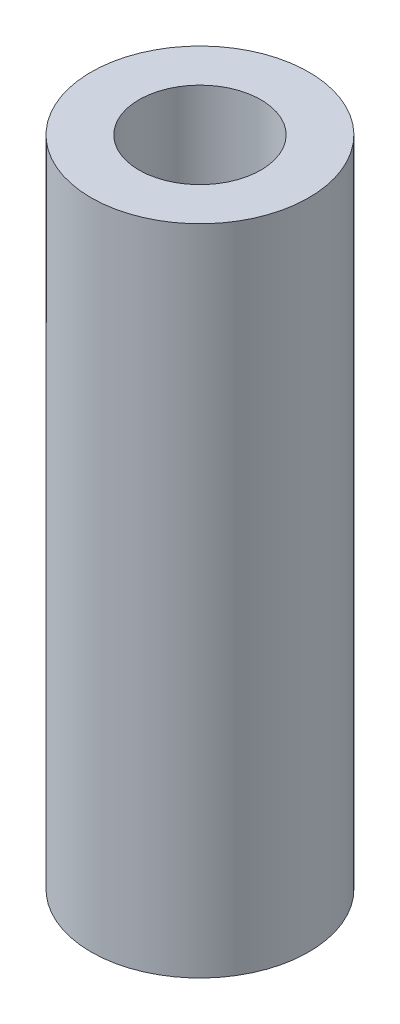
ISO-10303-21;
HEADER;
FILE_DESCRIPTION(('STEP AP214'),'2;1');
FILE_NAME('part.step','',(''),(''),'','','');
FILE_SCHEMA(('AUTOMOTIVE_DESIGN { 1 0 10303 214 1 1 1 1 }'));
ENDSEC;
DATA;
#1=APPLICATION_CONTEXT('core data for automotive mechanical design processes');
#2=APPLICATION_PROTOCOL_DEFINITION('international standard','automotive_design',2000,#1);
#3=PRODUCT_CONTEXT('',#1,'mechanical');
#4=PRODUCT('Part','Part','',(#3));
#5=PRODUCT_RELATED_PRODUCT_CATEGORY('part','',(#4));
#6=PRODUCT_DEFINITION_FORMATION('','',#4);
#7=PRODUCT_DEFINITION_CONTEXT('part definition',#1,'design');
#8=PRODUCT_DEFINITION('design','',#6,#7);
#9=PRODUCT_DEFINITION_SHAPE('','',#8);
#10=(LENGTH_UNIT() NAMED_UNIT(*) SI_UNIT(.MILLI.,.METRE.));
#11=(NAMED_UNIT(*) PLANE_ANGLE_UNIT() SI_UNIT($,.RADIAN.));
#12=(NAMED_UNIT(*) SI_UNIT($,.STERADIAN.) SOLID_ANGLE_UNIT());
#13=UNCERTAINTY_MEASURE_WITH_UNIT(LENGTH_MEASURE(1.E-05),#10,'distance_accuracy_value','');
#14=(GEOMETRIC_REPRESENTATION_CONTEXT(3) GLOBAL_UNCERTAINTY_ASSIGNED_CONTEXT((#13)) GLOBAL_UNIT_ASSIGNED_CONTEXT((#10,
#11,#12)) REPRESENTATION_CONTEXT('',''));
#15=CARTESIAN_POINT('',(0.,0.,0.));
#16=DIRECTION('',(0.,0.,1.));
#17=DIRECTION('',(1.,0.,0.));
#18=AXIS2_PLACEMENT_3D('',#15,#16,#17);
#19=CARTESIAN_POINT('',(0.,15.,0.));
#20=DIRECTION('',(0.,1.,0.));
#21=DIRECTION('',(0.,0.,1.));
#22=AXIS2_PLACEMENT_3D('',#19,#20,#21);
#23=PLANE('',#22);
#24=CARTESIAN_POINT('',(0.,15.,0.));
#25=DIRECTION('',(0.,1.,0.));
#26=DIRECTION('',(0.,0.,1.));
#27=AXIS2_PLACEMENT_3D('',#24,#25,#26);
#28=CIRCLE('',#27,2.5);
#29=CARTESIAN_POINT('',(0.,15.,2.5));
#30=VERTEX_POINT('',#29);
#31=EDGE_CURVE('E10',#30,#30,#28,.T.);
#32=ORIENTED_EDGE('',*,*,#31,.T.);
#33=EDGE_LOOP('',(#32));
#34=FACE_BOUND('',#33,.T.);
#35=CARTESIAN_POINT('',(0.,15.,0.));
#36=DIRECTION('',(0.,1.,0.));
#37=DIRECTION('',(0.,0.,1.));
#38=AXIS2_PLACEMENT_3D('',#35,#36,#37);
#39=CIRCLE('',#38,1.4);
#40=CARTESIAN_POINT('',(0.,15.,1.4));
#41=VERTEX_POINT('',#40);
#42=EDGE_CURVE('E52',#41,#41,#39,.T.);
#43=ORIENTED_EDGE('',*,*,#42,.F.);
#44=EDGE_LOOP('',(#43));
#45=FACE_BOUND('',#44,.T.);
#46=ADVANCED_FACE('F39',(#34,#45),#23,.T.);
#47=CARTESIAN_POINT('',(0.,0.,0.));
#48=DIRECTION('',(0.,1.,0.));
#49=DIRECTION('',(0.,0.,1.));
#50=AXIS2_PLACEMENT_3D('',#47,#48,#49);
#51=PLANE('',#50);
#52=CARTESIAN_POINT('',(0.,0.,0.));
#53=DIRECTION('',(0.,1.,0.));
#54=DIRECTION('',(0.,0.,1.));
#55=AXIS2_PLACEMENT_3D('',#52,#53,#54);
#56=CIRCLE('',#55,2.5);
#57=CARTESIAN_POINT('',(0.,0.,2.5));
#58=VERTEX_POINT('',#57);
#59=EDGE_CURVE('E43',#58,#58,#56,.T.);
#60=ORIENTED_EDGE('',*,*,#59,.F.);
#61=EDGE_LOOP('',(#60));
#62=FACE_BOUND('',#61,.T.);
#63=CARTESIAN_POINT('',(0.,0.,0.));
#64=DIRECTION('',(0.,1.,0.));
#65=DIRECTION('',(0.,0.,1.));
#66=AXIS2_PLACEMENT_3D('',#63,#64,#65);
#67=CIRCLE('',#66,1.4);
#68=CARTESIAN_POINT('',(0.,0.,1.4));
#69=VERTEX_POINT('',#68);
#70=EDGE_CURVE('E54',#69,#69,#67,.T.);
#71=ORIENTED_EDGE('',*,*,#70,.T.);
#72=EDGE_LOOP('',(#71));
#73=FACE_BOUND('',#72,.T.);
#74=ADVANCED_FACE('F66',(#62,#73),#51,.F.);
#75=CARTESIAN_POINT('',(0.,15.,0.));
#76=DIRECTION('',(0.,-1.,0.));
#77=DIRECTION('',(0.,0.,-1.));
#78=AXIS2_PLACEMENT_3D('',#75,#76,#77);
#79=CYLINDRICAL_SURFACE('',#78,2.5);
#80=ORIENTED_EDGE('',*,*,#31,.F.);
#81=EDGE_LOOP('',(#80));
#82=FACE_BOUND('',#81,.T.);
#83=ORIENTED_EDGE('',*,*,#59,.T.);
#84=EDGE_LOOP('',(#83));
#85=FACE_BOUND('',#84,.T.);
#86=ADVANCED_FACE('F41',(#82,#85),#79,.T.);
#87=CARTESIAN_POINT('',(0.,15.,0.));
#88=DIRECTION('',(0.,-1.,0.));
#89=DIRECTION('',(0.,0.,-1.));
#90=AXIS2_PLACEMENT_3D('',#87,#88,#89);
#91=CYLINDRICAL_SURFACE('',#90,1.4);
#92=ORIENTED_EDGE('',*,*,#42,.T.);
#93=EDGE_LOOP('',(#92));
#94=FACE_BOUND('',#93,.T.);
#95=ORIENTED_EDGE('',*,*,#70,.F.);
#96=EDGE_LOOP('',(#95));
#97=FACE_BOUND('',#96,.T.);
#98=ADVANCED_FACE('F62',(#94,#97),#91,.F.);
#99=CLOSED_SHELL('',(#46,#74,#86,#98));
#100=MANIFOLD_SOLID_BREP('B2',#99);
#101=ADVANCED_BREP_SHAPE_REPRESENTATION('',(#18,#100),#14);
#102=SHAPE_DEFINITION_REPRESENTATION(#9,#101);
ENDSEC;
END-ISO-10303-21;
